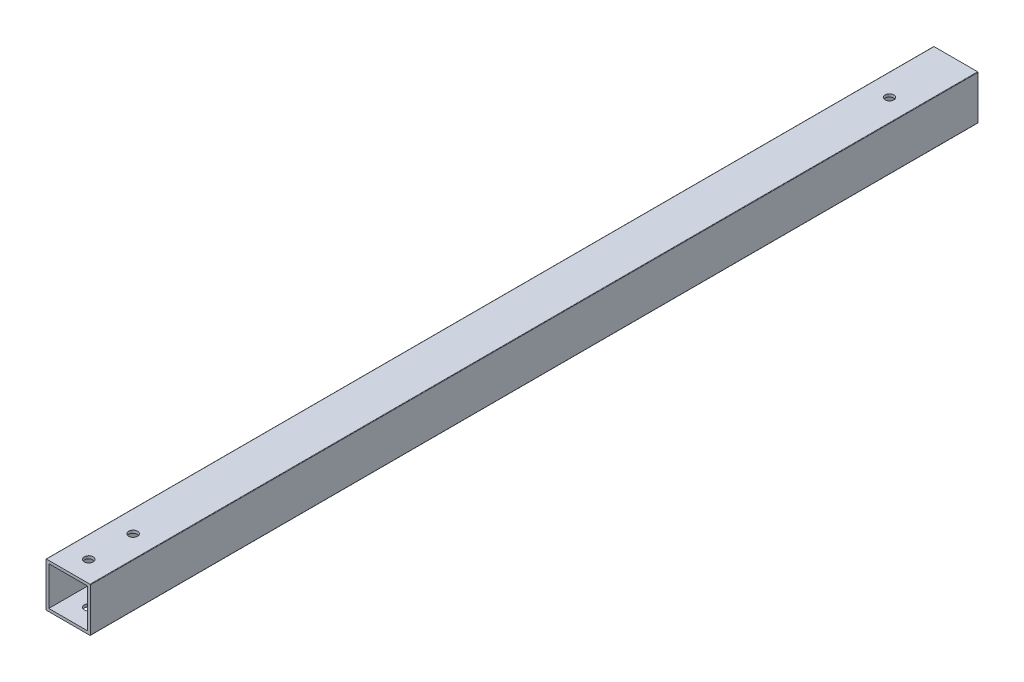
ISO-10303-21;
HEADER;
FILE_DESCRIPTION(('STEP AP214'),'2;1');
FILE_NAME('part.step','',(''),(''),'','','');
FILE_SCHEMA(('AUTOMOTIVE_DESIGN { 1 0 10303 214 1 1 1 1 }'));
ENDSEC;
DATA;
#1=APPLICATION_CONTEXT('core data for automotive mechanical design processes');
#2=APPLICATION_PROTOCOL_DEFINITION('international standard','automotive_design',2000,#1);
#3=PRODUCT_CONTEXT('',#1,'mechanical');
#4=PRODUCT('Part','Part','',(#3));
#5=PRODUCT_RELATED_PRODUCT_CATEGORY('part','',(#4));
#6=PRODUCT_DEFINITION_FORMATION('','',#4);
#7=PRODUCT_DEFINITION_CONTEXT('part definition',#1,'design');
#8=PRODUCT_DEFINITION('design','',#6,#7);
#9=PRODUCT_DEFINITION_SHAPE('','',#8);
#10=(LENGTH_UNIT() NAMED_UNIT(*) SI_UNIT(.MILLI.,.METRE.));
#11=(NAMED_UNIT(*) PLANE_ANGLE_UNIT() SI_UNIT($,.RADIAN.));
#12=(NAMED_UNIT(*) SI_UNIT($,.STERADIAN.) SOLID_ANGLE_UNIT());
#13=UNCERTAINTY_MEASURE_WITH_UNIT(LENGTH_MEASURE(1.E-05),#10,'distance_accuracy_value','');
#14=(GEOMETRIC_REPRESENTATION_CONTEXT(3) GLOBAL_UNCERTAINTY_ASSIGNED_CONTEXT((#13)) GLOBAL_UNIT_ASSIGNED_CONTEXT((#10,
#11,#12)) REPRESENTATION_CONTEXT('',''));
#15=CARTESIAN_POINT('',(0.,0.,0.));
#16=DIRECTION('',(0.,0.,1.));
#17=DIRECTION('',(1.,0.,0.));
#18=AXIS2_PLACEMENT_3D('',#15,#16,#17);
#19=CARTESIAN_POINT('',(-1.33350000000001,-1.3335,508.));
#20=DIRECTION('',(0.,0.,-1.));
#21=DIRECTION('',(-1.,0.,0.));
#22=AXIS2_PLACEMENT_3D('',#19,#20,#21);
#23=CYLINDRICAL_SURFACE('',#22,0.253999999999997);
#24=CARTESIAN_POINT('',(-1.33350000000001,-1.3335,0.));
#25=DIRECTION('',(0.,0.,-1.));
#26=DIRECTION('',(-1.,0.,0.));
#27=AXIS2_PLACEMENT_3D('',#24,#25,#26);
#28=CIRCLE('',#27,0.253999999999997);
#29=CARTESIAN_POINT('',(-1.33350000000001,-1.5875,0.));
#30=VERTEX_POINT('',#29);
#31=CARTESIAN_POINT('',(-1.5875,-1.3335,0.));
#32=VERTEX_POINT('',#31);
#33=EDGE_CURVE('E158',#30,#32,#28,.T.);
#34=ORIENTED_EDGE('',*,*,#33,.F.);
#35=DIRECTION('',(0.,0.,-1.));
#36=VECTOR('',#35,1.);
#37=CARTESIAN_POINT('',(-1.33350000000001,-1.5875,508.));
#38=LINE('',#37,#36);
#39=CARTESIAN_POINT('',(-1.33350000000001,-1.5875,508.));
#40=VERTEX_POINT('',#39);
#41=EDGE_CURVE('E11',#40,#30,#38,.T.);
#42=ORIENTED_EDGE('',*,*,#41,.F.);
#43=CARTESIAN_POINT('',(-1.33350000000001,-1.3335,508.));
#44=DIRECTION('',(0.,0.,-1.));
#45=DIRECTION('',(-1.,0.,0.));
#46=AXIS2_PLACEMENT_3D('',#43,#44,#45);
#47=CIRCLE('',#46,0.253999999999997);
#48=CARTESIAN_POINT('',(-1.5875,-1.3335,508.));
#49=VERTEX_POINT('',#48);
#50=EDGE_CURVE('E162',#40,#49,#47,.T.);
#51=ORIENTED_EDGE('',*,*,#50,.T.);
#52=DIRECTION('',(0.,0.,-1.));
#53=VECTOR('',#52,1.);
#54=CARTESIAN_POINT('',(-1.5875,-1.3335,508.));
#55=LINE('',#54,#53);
#56=EDGE_CURVE('E187',#49,#32,#55,.T.);
#57=ORIENTED_EDGE('',*,*,#56,.T.);
#58=EDGE_LOOP('',(#34,#42,#51,#57));
#59=FACE_BOUND('',#58,.T.);
#60=ADVANCED_FACE('F33',(#59),#23,.T.);
#61=CARTESIAN_POINT('',(23.5585,-1.5875,508.));
#62=DIRECTION('',(0.,-1.,0.));
#63=DIRECTION('',(1.,0.,0.));
#64=AXIS2_PLACEMENT_3D('',#61,#62,#63);
#65=PLANE('',#64);
#66=CARTESIAN_POINT('',(11.1125,-1.5875,37.933268304));
#67=DIRECTION('',(0.,1.,0.));
#68=DIRECTION('',(0.,0.,1.));
#69=AXIS2_PLACEMENT_3D('',#66,#67,#68);
#70=CIRCLE('',#69,2.4892);
#71=CARTESIAN_POINT('',(11.1125,-1.5875,40.422468304));
#72=VERTEX_POINT('',#71);
#73=EDGE_CURVE('E252',#72,#72,#70,.T.);
#74=ORIENTED_EDGE('',*,*,#73,.T.);
#75=EDGE_LOOP('',(#74));
#76=FACE_BOUND('',#75,.T.);
#77=CARTESIAN_POINT('',(10.9125000000001,-1.5875,470.65));
#78=DIRECTION('',(0.,-1.,0.));
#79=DIRECTION('',(1.,0.,0.));
#80=AXIS2_PLACEMENT_3D('',#77,#78,#79);
#81=CIRCLE('',#80,2.54);
#82=CARTESIAN_POINT('',(13.4525000000001,-1.5875,470.65));
#83=VERTEX_POINT('',#82);
#84=EDGE_CURVE('E242',#83,#83,#81,.T.);
#85=ORIENTED_EDGE('',*,*,#84,.F.);
#86=EDGE_LOOP('',(#85));
#87=FACE_BOUND('',#86,.T.);
#88=CARTESIAN_POINT('',(10.9125000000001,-1.5875,496.05));
#89=DIRECTION('',(0.,-1.,0.));
#90=DIRECTION('',(1.,0.,0.));
#91=AXIS2_PLACEMENT_3D('',#88,#89,#90);
#92=CIRCLE('',#91,2.54000000000002);
#93=CARTESIAN_POINT('',(13.4525000000001,-1.5875,496.05));
#94=VERTEX_POINT('',#93);
#95=EDGE_CURVE('E235',#94,#94,#92,.T.);
#96=ORIENTED_EDGE('',*,*,#95,.F.);
#97=EDGE_LOOP('',(#96));
#98=FACE_BOUND('',#97,.T.);
#99=DIRECTION('',(-1.,0.,0.));
#100=VECTOR('',#99,1.);
#101=CARTESIAN_POINT('',(23.5585,-1.5875,0.));
#102=LINE('',#101,#100);
#103=CARTESIAN_POINT('',(23.5585,-1.5875,0.));
#104=VERTEX_POINT('',#103);
#105=EDGE_CURVE('E166',#104,#30,#102,.T.);
#106=ORIENTED_EDGE('',*,*,#105,.F.);
#107=DIRECTION('',(0.,0.,-1.));
#108=VECTOR('',#107,1.);
#109=CARTESIAN_POINT('',(23.5585,-1.5875,508.));
#110=LINE('',#109,#108);
#111=CARTESIAN_POINT('',(23.5585,-1.5875,508.));
#112=VERTEX_POINT('',#111);
#113=EDGE_CURVE('E41',#112,#104,#110,.T.);
#114=ORIENTED_EDGE('',*,*,#113,.F.);
#115=DIRECTION('',(-1.,0.,0.));
#116=VECTOR('',#115,1.);
#117=CARTESIAN_POINT('',(23.5585,-1.5875,508.));
#118=LINE('',#117,#116);
#119=EDGE_CURVE('E184',#112,#40,#118,.T.);
#120=ORIENTED_EDGE('',*,*,#119,.T.);
#121=ORIENTED_EDGE('',*,*,#41,.T.);
#122=EDGE_LOOP('',(#106,#114,#120,#121));
#123=FACE_BOUND('',#122,.T.);
#124=ADVANCED_FACE('F276',(#76,#87,#98,#123),#65,.T.);
#125=CARTESIAN_POINT('',(23.5585,-1.3335,508.));
#126=DIRECTION('',(0.,0.,-1.));
#127=DIRECTION('',(-1.,0.,0.));
#128=AXIS2_PLACEMENT_3D('',#125,#126,#127);
#129=CYLINDRICAL_SURFACE('',#128,0.253999999999998);
#130=CARTESIAN_POINT('',(23.5585,-1.3335,0.));
#131=DIRECTION('',(0.,0.,-1.));
#132=DIRECTION('',(-1.,0.,0.));
#133=AXIS2_PLACEMENT_3D('',#130,#131,#132);
#134=CIRCLE('',#133,0.253999999999998);
#135=CARTESIAN_POINT('',(23.8125,-1.3335,0.));
#136=VERTEX_POINT('',#135);
#137=EDGE_CURVE('E205',#136,#104,#134,.T.);
#138=ORIENTED_EDGE('',*,*,#137,.F.);
#139=DIRECTION('',(0.,0.,-1.));
#140=VECTOR('',#139,1.);
#141=CARTESIAN_POINT('',(23.8125,-1.3335,508.));
#142=LINE('',#141,#140);
#143=CARTESIAN_POINT('',(23.8125,-1.3335,508.));
#144=VERTEX_POINT('',#143);
#145=EDGE_CURVE('E211',#144,#136,#142,.T.);
#146=ORIENTED_EDGE('',*,*,#145,.F.);
#147=CARTESIAN_POINT('',(23.5585,-1.3335,508.));
#148=DIRECTION('',(0.,0.,-1.));
#149=DIRECTION('',(-1.,0.,0.));
#150=AXIS2_PLACEMENT_3D('',#147,#148,#149);
#151=CIRCLE('',#150,0.253999999999998);
#152=EDGE_CURVE('E181',#144,#112,#151,.T.);
#153=ORIENTED_EDGE('',*,*,#152,.T.);
#154=ORIENTED_EDGE('',*,*,#113,.T.);
#155=EDGE_LOOP('',(#138,#146,#153,#154));
#156=FACE_BOUND('',#155,.T.);
#157=ADVANCED_FACE('F281',(#156),#129,.T.);
#158=CARTESIAN_POINT('',(23.8125,23.5585,508.));
#159=DIRECTION('',(1.,0.,0.));
#160=DIRECTION('',(0.,1.,0.));
#161=AXIS2_PLACEMENT_3D('',#158,#159,#160);
#162=PLANE('',#161);
#163=DIRECTION('',(0.,-1.,0.));
#164=VECTOR('',#163,1.);
#165=CARTESIAN_POINT('',(23.8125,23.5585,0.));
#166=LINE('',#165,#164);
#167=CARTESIAN_POINT('',(23.8125,23.5585,0.));
#168=VERTEX_POINT('',#167);
#169=EDGE_CURVE('E202',#168,#136,#166,.T.);
#170=ORIENTED_EDGE('',*,*,#169,.F.);
#171=DIRECTION('',(0.,0.,-1.));
#172=VECTOR('',#171,1.);
#173=CARTESIAN_POINT('',(23.8125,23.5585,508.));
#174=LINE('',#173,#172);
#175=CARTESIAN_POINT('',(23.8125,23.5585,508.));
#176=VERTEX_POINT('',#175);
#177=EDGE_CURVE('E213',#176,#168,#174,.T.);
#178=ORIENTED_EDGE('',*,*,#177,.F.);
#179=DIRECTION('',(0.,-1.,0.));
#180=VECTOR('',#179,1.);
#181=CARTESIAN_POINT('',(23.8125,23.5585,508.));
#182=LINE('',#181,#180);
#183=EDGE_CURVE('E178',#176,#144,#182,.T.);
#184=ORIENTED_EDGE('',*,*,#183,.T.);
#185=ORIENTED_EDGE('',*,*,#145,.T.);
#186=EDGE_LOOP('',(#170,#178,#184,#185));
#187=FACE_BOUND('',#186,.T.);
#188=ADVANCED_FACE('F311',(#187),#162,.T.);
#189=CARTESIAN_POINT('',(23.5585,23.5585,508.));
#190=DIRECTION('',(0.,0.,-1.));
#191=DIRECTION('',(-1.,0.,0.));
#192=AXIS2_PLACEMENT_3D('',#189,#190,#191);
#193=CYLINDRICAL_SURFACE('',#192,0.254000000000001);
#194=CARTESIAN_POINT('',(23.5585,23.5585,0.));
#195=DIRECTION('',(0.,0.,-1.));
#196=DIRECTION('',(-1.,0.,0.));
#197=AXIS2_PLACEMENT_3D('',#194,#195,#196);
#198=CIRCLE('',#197,0.254000000000001);
#199=CARTESIAN_POINT('',(23.5585,23.8125,0.));
#200=VERTEX_POINT('',#199);
#201=EDGE_CURVE('E199',#200,#168,#198,.T.);
#202=ORIENTED_EDGE('',*,*,#201,.F.);
#203=DIRECTION('',(0.,0.,-1.));
#204=VECTOR('',#203,1.);
#205=CARTESIAN_POINT('',(23.5585,23.8125,508.));
#206=LINE('',#205,#204);
#207=CARTESIAN_POINT('',(23.5585,23.8125,508.));
#208=VERTEX_POINT('',#207);
#209=EDGE_CURVE('E215',#208,#200,#206,.T.);
#210=ORIENTED_EDGE('',*,*,#209,.F.);
#211=CARTESIAN_POINT('',(23.5585,23.5585,508.));
#212=DIRECTION('',(0.,0.,-1.));
#213=DIRECTION('',(-1.,0.,0.));
#214=AXIS2_PLACEMENT_3D('',#211,#212,#213);
#215=CIRCLE('',#214,0.254000000000001);
#216=EDGE_CURVE('E175',#208,#176,#215,.T.);
#217=ORIENTED_EDGE('',*,*,#216,.T.);
#218=ORIENTED_EDGE('',*,*,#177,.T.);
#219=EDGE_LOOP('',(#202,#210,#217,#218));
#220=FACE_BOUND('',#219,.T.);
#221=ADVANCED_FACE('F308',(#220),#193,.T.);
#222=CARTESIAN_POINT('',(-1.33350000000001,23.8125,508.));
#223=DIRECTION('',(0.,1.,0.));
#224=DIRECTION('',(0.,0.,1.));
#225=AXIS2_PLACEMENT_3D('',#222,#223,#224);
#226=PLANE('',#225);
#227=CARTESIAN_POINT('',(11.1125,23.8125,37.933268304));
#228=DIRECTION('',(0.,1.,0.));
#229=DIRECTION('',(0.,0.,1.));
#230=AXIS2_PLACEMENT_3D('',#227,#228,#229);
#231=CIRCLE('',#230,2.4892);
#232=CARTESIAN_POINT('',(11.1125,23.8125,40.422468304));
#233=VERTEX_POINT('',#232);
#234=EDGE_CURVE('E249',#233,#233,#231,.T.);
#235=ORIENTED_EDGE('',*,*,#234,.F.);
#236=EDGE_LOOP('',(#235));
#237=FACE_BOUND('',#236,.T.);
#238=CARTESIAN_POINT('',(10.9125000000001,23.8125,470.65));
#239=DIRECTION('',(0.,-1.,0.));
#240=DIRECTION('',(1.,0.,0.));
#241=AXIS2_PLACEMENT_3D('',#238,#239,#240);
#242=CIRCLE('',#241,2.54);
#243=CARTESIAN_POINT('',(13.4525000000001,23.8125,470.65));
#244=VERTEX_POINT('',#243);
#245=EDGE_CURVE('E225',#244,#244,#242,.T.);
#246=ORIENTED_EDGE('',*,*,#245,.T.);
#247=EDGE_LOOP('',(#246));
#248=FACE_BOUND('',#247,.T.);
#249=CARTESIAN_POINT('',(10.9125000000001,23.8125,496.05));
#250=DIRECTION('',(0.,-1.,0.));
#251=DIRECTION('',(1.,0.,0.));
#252=AXIS2_PLACEMENT_3D('',#249,#250,#251);
#253=CIRCLE('',#252,2.54000000000002);
#254=CARTESIAN_POINT('',(13.4525000000001,23.8125,496.05));
#255=VERTEX_POINT('',#254);
#256=EDGE_CURVE('E238',#255,#255,#253,.T.);
#257=ORIENTED_EDGE('',*,*,#256,.T.);
#258=EDGE_LOOP('',(#257));
#259=FACE_BOUND('',#258,.T.);
#260=DIRECTION('',(1.,0.,0.));
#261=VECTOR('',#260,1.);
#262=CARTESIAN_POINT('',(-1.33350000000001,23.8125,0.));
#263=LINE('',#262,#261);
#264=CARTESIAN_POINT('',(-1.33350000000001,23.8125,0.));
#265=VERTEX_POINT('',#264);
#266=EDGE_CURVE('E196',#265,#200,#263,.T.);
#267=ORIENTED_EDGE('',*,*,#266,.F.);
#268=DIRECTION('',(0.,0.,-1.));
#269=VECTOR('',#268,1.);
#270=CARTESIAN_POINT('',(-1.33350000000001,23.8125,508.));
#271=LINE('',#270,#269);
#272=CARTESIAN_POINT('',(-1.33350000000001,23.8125,508.));
#273=VERTEX_POINT('',#272);
#274=EDGE_CURVE('E217',#273,#265,#271,.T.);
#275=ORIENTED_EDGE('',*,*,#274,.F.);
#276=DIRECTION('',(1.,0.,0.));
#277=VECTOR('',#276,1.);
#278=CARTESIAN_POINT('',(-1.33350000000001,23.8125,508.));
#279=LINE('',#278,#277);
#280=EDGE_CURVE('E172',#273,#208,#279,.T.);
#281=ORIENTED_EDGE('',*,*,#280,.T.);
#282=ORIENTED_EDGE('',*,*,#209,.T.);
#283=EDGE_LOOP('',(#267,#275,#281,#282));
#284=FACE_BOUND('',#283,.T.);
#285=ADVANCED_FACE('F304',(#237,#248,#259,#284),#226,.T.);
#286=CARTESIAN_POINT('',(-1.33350000000001,23.5585,508.));
#287=DIRECTION('',(0.,0.,-1.));
#288=DIRECTION('',(-1.,0.,0.));
#289=AXIS2_PLACEMENT_3D('',#286,#287,#288);
#290=CYLINDRICAL_SURFACE('',#289,0.253999999999992);
#291=CARTESIAN_POINT('',(-1.33350000000001,23.5585,0.));
#292=DIRECTION('',(0.,0.,-1.));
#293=DIRECTION('',(-1.,0.,0.));
#294=AXIS2_PLACEMENT_3D('',#291,#292,#293);
#295=CIRCLE('',#294,0.253999999999992);
#296=CARTESIAN_POINT('',(-1.5875,23.5585,0.));
#297=VERTEX_POINT('',#296);
#298=EDGE_CURVE('E193',#297,#265,#295,.T.);
#299=ORIENTED_EDGE('',*,*,#298,.F.);
#300=DIRECTION('',(0.,0.,-1.));
#301=VECTOR('',#300,1.);
#302=CARTESIAN_POINT('',(-1.5875,23.5585,508.));
#303=LINE('',#302,#301);
#304=CARTESIAN_POINT('',(-1.5875,23.5585,508.));
#305=VERTEX_POINT('',#304);
#306=EDGE_CURVE('E219',#305,#297,#303,.T.);
#307=ORIENTED_EDGE('',*,*,#306,.F.);
#308=CARTESIAN_POINT('',(-1.33350000000001,23.5585,508.));
#309=DIRECTION('',(0.,0.,-1.));
#310=DIRECTION('',(-1.,0.,0.));
#311=AXIS2_PLACEMENT_3D('',#308,#309,#310);
#312=CIRCLE('',#311,0.253999999999992);
#313=EDGE_CURVE('E169',#305,#273,#312,.T.);
#314=ORIENTED_EDGE('',*,*,#313,.T.);
#315=ORIENTED_EDGE('',*,*,#274,.T.);
#316=EDGE_LOOP('',(#299,#307,#314,#315));
#317=FACE_BOUND('',#316,.T.);
#318=ADVANCED_FACE('F302',(#317),#290,.T.);
#319=CARTESIAN_POINT('',(-1.5875,-1.3335,508.));
#320=DIRECTION('',(-1.,0.,0.));
#321=DIRECTION('',(0.,-1.,0.));
#322=AXIS2_PLACEMENT_3D('',#319,#320,#321);
#323=PLANE('',#322);
#324=DIRECTION('',(0.,1.,0.));
#325=VECTOR('',#324,1.);
#326=CARTESIAN_POINT('',(-1.5875,-1.3335,0.));
#327=LINE('',#326,#325);
#328=EDGE_CURVE('E190',#32,#297,#327,.T.);
#329=ORIENTED_EDGE('',*,*,#328,.F.);
#330=ORIENTED_EDGE('',*,*,#56,.F.);
#331=DIRECTION('',(0.,1.,0.));
#332=VECTOR('',#331,1.);
#333=CARTESIAN_POINT('',(-1.5875,-1.3335,508.));
#334=LINE('',#333,#332);
#335=EDGE_CURVE('E165',#49,#305,#334,.T.);
#336=ORIENTED_EDGE('',*,*,#335,.T.);
#337=ORIENTED_EDGE('',*,*,#306,.T.);
#338=EDGE_LOOP('',(#329,#330,#336,#337));
#339=FACE_BOUND('',#338,.T.);
#340=ADVANCED_FACE('F298',(#339),#323,.T.);
#341=CARTESIAN_POINT('',(-1.33350000000001,-1.3335,508.));
#342=DIRECTION('',(0.,0.,-1.));
#343=DIRECTION('',(-1.,0.,0.));
#344=AXIS2_PLACEMENT_3D('',#341,#342,#343);
#345=PLANE('',#344);
#346=DIRECTION('',(1.,0.,0.));
#347=VECTOR('',#346,1.);
#348=CARTESIAN_POINT('',(0.,22.225,508.));
#349=LINE('',#348,#347);
#350=CARTESIAN_POINT('',(0.,22.225,508.));
#351=VERTEX_POINT('',#350);
#352=CARTESIAN_POINT('',(22.225,22.225,508.));
#353=VERTEX_POINT('',#352);
#354=EDGE_CURVE('E130',#351,#353,#349,.T.);
#355=ORIENTED_EDGE('',*,*,#354,.T.);
#356=DIRECTION('',(0.,-1.,0.));
#357=VECTOR('',#356,1.);
#358=CARTESIAN_POINT('',(22.225,22.225,508.));
#359=LINE('',#358,#357);
#360=CARTESIAN_POINT('',(22.225,0.,508.));
#361=VERTEX_POINT('',#360);
#362=EDGE_CURVE('E124',#353,#361,#359,.T.);
#363=ORIENTED_EDGE('',*,*,#362,.T.);
#364=DIRECTION('',(-1.,0.,0.));
#365=VECTOR('',#364,1.);
#366=CARTESIAN_POINT('',(0.,0.,508.));
#367=LINE('',#366,#365);
#368=CARTESIAN_POINT('',(0.,0.,508.));
#369=VERTEX_POINT('',#368);
#370=EDGE_CURVE('E133',#361,#369,#367,.T.);
#371=ORIENTED_EDGE('',*,*,#370,.T.);
#372=DIRECTION('',(0.,1.,0.));
#373=VECTOR('',#372,1.);
#374=CARTESIAN_POINT('',(0.,22.225,508.));
#375=LINE('',#374,#373);
#376=EDGE_CURVE('E49',#369,#351,#375,.T.);
#377=ORIENTED_EDGE('',*,*,#376,.T.);
#378=EDGE_LOOP('',(#355,#363,#371,#377));
#379=FACE_BOUND('',#378,.T.);
#380=ORIENTED_EDGE('',*,*,#50,.F.);
#381=ORIENTED_EDGE('',*,*,#119,.F.);
#382=ORIENTED_EDGE('',*,*,#152,.F.);
#383=ORIENTED_EDGE('',*,*,#183,.F.);
#384=ORIENTED_EDGE('',*,*,#216,.F.);
#385=ORIENTED_EDGE('',*,*,#280,.F.);
#386=ORIENTED_EDGE('',*,*,#313,.F.);
#387=ORIENTED_EDGE('',*,*,#335,.F.);
#388=EDGE_LOOP('',(#380,#381,#382,#383,#384,#385,#386,#387));
#389=FACE_BOUND('',#388,.T.);
#390=ADVANCED_FACE('F137',(#379,#389),#345,.F.);
#391=CARTESIAN_POINT('',(-1.33350000000001,-1.3335,0.));
#392=DIRECTION('',(0.,0.,-1.));
#393=DIRECTION('',(-1.,0.,0.));
#394=AXIS2_PLACEMENT_3D('',#391,#392,#393);
#395=PLANE('',#394);
#396=DIRECTION('',(0.,-1.,0.));
#397=VECTOR('',#396,1.);
#398=CARTESIAN_POINT('',(22.225,22.225,0.));
#399=LINE('',#398,#397);
#400=CARTESIAN_POINT('',(22.225,22.225,0.));
#401=VERTEX_POINT('',#400);
#402=CARTESIAN_POINT('',(22.225,0.,0.));
#403=VERTEX_POINT('',#402);
#404=EDGE_CURVE('E57',#401,#403,#399,.T.);
#405=ORIENTED_EDGE('',*,*,#404,.F.);
#406=DIRECTION('',(1.,0.,0.));
#407=VECTOR('',#406,1.);
#408=CARTESIAN_POINT('',(0.,22.225,0.));
#409=LINE('',#408,#407);
#410=CARTESIAN_POINT('',(0.,22.225,0.));
#411=VERTEX_POINT('',#410);
#412=EDGE_CURVE('E140',#411,#401,#409,.T.);
#413=ORIENTED_EDGE('',*,*,#412,.F.);
#414=DIRECTION('',(0.,1.,0.));
#415=VECTOR('',#414,1.);
#416=CARTESIAN_POINT('',(0.,22.225,0.));
#417=LINE('',#416,#415);
#418=CARTESIAN_POINT('',(0.,0.,0.));
#419=VERTEX_POINT('',#418);
#420=EDGE_CURVE('E143',#419,#411,#417,.T.);
#421=ORIENTED_EDGE('',*,*,#420,.F.);
#422=DIRECTION('',(-1.,0.,0.));
#423=VECTOR('',#422,1.);
#424=CARTESIAN_POINT('',(0.,0.,0.));
#425=LINE('',#424,#423);
#426=EDGE_CURVE('E152',#403,#419,#425,.T.);
#427=ORIENTED_EDGE('',*,*,#426,.F.);
#428=EDGE_LOOP('',(#405,#413,#421,#427));
#429=FACE_BOUND('',#428,.T.);
#430=ORIENTED_EDGE('',*,*,#33,.T.);
#431=ORIENTED_EDGE('',*,*,#328,.T.);
#432=ORIENTED_EDGE('',*,*,#298,.T.);
#433=ORIENTED_EDGE('',*,*,#266,.T.);
#434=ORIENTED_EDGE('',*,*,#201,.T.);
#435=ORIENTED_EDGE('',*,*,#169,.T.);
#436=ORIENTED_EDGE('',*,*,#137,.T.);
#437=ORIENTED_EDGE('',*,*,#105,.T.);
#438=EDGE_LOOP('',(#430,#431,#432,#433,#434,#435,#436,#437));
#439=FACE_BOUND('',#438,.T.);
#440=ADVANCED_FACE('F288',(#429,#439),#395,.T.);
#441=CARTESIAN_POINT('',(22.225,22.225,508.));
#442=DIRECTION('',(1.,0.,0.));
#443=DIRECTION('',(0.,1.,0.));
#444=AXIS2_PLACEMENT_3D('',#441,#442,#443);
#445=PLANE('',#444);
#446=ORIENTED_EDGE('',*,*,#404,.T.);
#447=DIRECTION('',(0.,0.,-1.));
#448=VECTOR('',#447,1.);
#449=CARTESIAN_POINT('',(22.225,0.,508.));
#450=LINE('',#449,#448);
#451=EDGE_CURVE('E120',#361,#403,#450,.T.);
#452=ORIENTED_EDGE('',*,*,#451,.F.);
#453=ORIENTED_EDGE('',*,*,#362,.F.);
#454=DIRECTION('',(0.,0.,-1.));
#455=VECTOR('',#454,1.);
#456=CARTESIAN_POINT('',(22.225,22.225,508.));
#457=LINE('',#456,#455);
#458=EDGE_CURVE('E156',#353,#401,#457,.T.);
#459=ORIENTED_EDGE('',*,*,#458,.T.);
#460=EDGE_LOOP('',(#446,#452,#453,#459));
#461=FACE_BOUND('',#460,.T.);
#462=ADVANCED_FACE('F122',(#461),#445,.F.);
#463=CARTESIAN_POINT('',(0.,22.225,508.));
#464=DIRECTION('',(0.,1.,0.));
#465=DIRECTION('',(-1.,0.,0.));
#466=AXIS2_PLACEMENT_3D('',#463,#464,#465);
#467=PLANE('',#466);
#468=CARTESIAN_POINT('',(11.1125,22.225,37.933268304));
#469=DIRECTION('',(0.,1.,0.));
#470=DIRECTION('',(-1.,0.,0.));
#471=AXIS2_PLACEMENT_3D('',#468,#469,#470);
#472=CIRCLE('',#471,2.4892);
#473=CARTESIAN_POINT('',(8.6233,22.225,37.933268304));
#474=VERTEX_POINT('',#473);
#475=EDGE_CURVE('E239',#474,#474,#472,.T.);
#476=ORIENTED_EDGE('',*,*,#475,.T.);
#477=EDGE_LOOP('',(#476));
#478=FACE_BOUND('',#477,.T.);
#479=CARTESIAN_POINT('',(10.9125000000001,22.225,470.65));
#480=DIRECTION('',(0.,1.,0.));
#481=DIRECTION('',(-1.,0.,0.));
#482=AXIS2_PLACEMENT_3D('',#479,#480,#481);
#483=CIRCLE('',#482,2.54);
#484=CARTESIAN_POINT('',(8.37250000000008,22.225,470.65));
#485=VERTEX_POINT('',#484);
#486=EDGE_CURVE('E146',#485,#485,#483,.T.);
#487=ORIENTED_EDGE('',*,*,#486,.T.);
#488=EDGE_LOOP('',(#487));
#489=FACE_BOUND('',#488,.T.);
#490=CARTESIAN_POINT('',(10.9125000000001,22.225,496.05));
#491=DIRECTION('',(0.,1.,0.));
#492=DIRECTION('',(-1.,0.,0.));
#493=AXIS2_PLACEMENT_3D('',#490,#491,#492);
#494=CIRCLE('',#493,2.54000000000002);
#495=CARTESIAN_POINT('',(8.37250000000006,22.225,496.05));
#496=VERTEX_POINT('',#495);
#497=EDGE_CURVE('E224',#496,#496,#494,.T.);
#498=ORIENTED_EDGE('',*,*,#497,.T.);
#499=EDGE_LOOP('',(#498));
#500=FACE_BOUND('',#499,.T.);
#501=ORIENTED_EDGE('',*,*,#412,.T.);
#502=ORIENTED_EDGE('',*,*,#458,.F.);
#503=ORIENTED_EDGE('',*,*,#354,.F.);
#504=DIRECTION('',(0.,0.,-1.));
#505=VECTOR('',#504,1.);
#506=CARTESIAN_POINT('',(0.,22.225,508.));
#507=LINE('',#506,#505);
#508=EDGE_CURVE('E159',#351,#411,#507,.T.);
#509=ORIENTED_EDGE('',*,*,#508,.T.);
#510=EDGE_LOOP('',(#501,#502,#503,#509));
#511=FACE_BOUND('',#510,.T.);
#512=ADVANCED_FACE('F339',(#478,#489,#500,#511),#467,.F.);
#513=CARTESIAN_POINT('',(0.,22.225,508.));
#514=DIRECTION('',(-1.,0.,0.));
#515=DIRECTION('',(0.,-1.,0.));
#516=AXIS2_PLACEMENT_3D('',#513,#514,#515);
#517=PLANE('',#516);
#518=ORIENTED_EDGE('',*,*,#420,.T.);
#519=ORIENTED_EDGE('',*,*,#508,.F.);
#520=ORIENTED_EDGE('',*,*,#376,.F.);
#521=DIRECTION('',(0.,0.,-1.));
#522=VECTOR('',#521,1.);
#523=CARTESIAN_POINT('',(0.,0.,508.));
#524=LINE('',#523,#522);
#525=EDGE_CURVE('E129',#369,#419,#524,.T.);
#526=ORIENTED_EDGE('',*,*,#525,.T.);
#527=EDGE_LOOP('',(#518,#519,#520,#526));
#528=FACE_BOUND('',#527,.T.);
#529=ADVANCED_FACE('F343',(#528),#517,.F.);
#530=CARTESIAN_POINT('',(0.,0.,508.));
#531=DIRECTION('',(0.,-1.,0.));
#532=DIRECTION('',(1.,0.,0.));
#533=AXIS2_PLACEMENT_3D('',#530,#531,#532);
#534=PLANE('',#533);
#535=CARTESIAN_POINT('',(11.1125,0.,37.933268304));
#536=DIRECTION('',(0.,-1.,0.));
#537=DIRECTION('',(1.,0.,0.));
#538=AXIS2_PLACEMENT_3D('',#535,#536,#537);
#539=CIRCLE('',#538,2.4892);
#540=CARTESIAN_POINT('',(13.6017,0.,37.933268304));
#541=VERTEX_POINT('',#540);
#542=EDGE_CURVE('E36',#541,#541,#539,.T.);
#543=ORIENTED_EDGE('',*,*,#542,.T.);
#544=EDGE_LOOP('',(#543));
#545=FACE_BOUND('',#544,.T.);
#546=CARTESIAN_POINT('',(10.9125000000001,0.,470.65));
#547=DIRECTION('',(0.,-1.,0.));
#548=DIRECTION('',(1.,0.,0.));
#549=AXIS2_PLACEMENT_3D('',#546,#547,#548);
#550=CIRCLE('',#549,2.54);
#551=CARTESIAN_POINT('',(13.4525000000001,0.,470.65));
#552=VERTEX_POINT('',#551);
#553=EDGE_CURVE('E226',#552,#552,#550,.T.);
#554=ORIENTED_EDGE('',*,*,#553,.T.);
#555=EDGE_LOOP('',(#554));
#556=FACE_BOUND('',#555,.T.);
#557=CARTESIAN_POINT('',(10.9125000000001,0.,496.05));
#558=DIRECTION('',(0.,-1.,0.));
#559=DIRECTION('',(1.,0.,0.));
#560=AXIS2_PLACEMENT_3D('',#557,#558,#559);
#561=CIRCLE('',#560,2.54000000000002);
#562=CARTESIAN_POINT('',(13.4525000000001,0.,496.05));
#563=VERTEX_POINT('',#562);
#564=EDGE_CURVE('E222',#563,#563,#561,.T.);
#565=ORIENTED_EDGE('',*,*,#564,.T.);
#566=EDGE_LOOP('',(#565));
#567=FACE_BOUND('',#566,.T.);
#568=ORIENTED_EDGE('',*,*,#426,.T.);
#569=ORIENTED_EDGE('',*,*,#525,.F.);
#570=ORIENTED_EDGE('',*,*,#370,.F.);
#571=ORIENTED_EDGE('',*,*,#451,.T.);
#572=EDGE_LOOP('',(#568,#569,#570,#571));
#573=FACE_BOUND('',#572,.T.);
#574=ADVANCED_FACE('F134',(#545,#556,#567,#573),#534,.F.);
#575=CARTESIAN_POINT('',(10.9125000000001,23.8125,496.05));
#576=DIRECTION('',(0.,-1.,0.));
#577=DIRECTION('',(1.,0.,0.));
#578=AXIS2_PLACEMENT_3D('',#575,#576,#577);
#579=CYLINDRICAL_SURFACE('',#578,2.54000000000002);
#580=ORIENTED_EDGE('',*,*,#95,.T.);
#581=EDGE_LOOP('',(#580));
#582=FACE_BOUND('',#581,.T.);
#583=ORIENTED_EDGE('',*,*,#564,.F.);
#584=EDGE_LOOP('',(#583));
#585=FACE_BOUND('',#584,.T.);
#586=ADVANCED_FACE('F342',(#582,#585),#579,.F.);
#587=CARTESIAN_POINT('',(10.9125000000001,23.8125,470.65));
#588=DIRECTION('',(0.,-1.,0.));
#589=DIRECTION('',(1.,0.,0.));
#590=AXIS2_PLACEMENT_3D('',#587,#588,#589);
#591=CYLINDRICAL_SURFACE('',#590,2.54);
#592=ORIENTED_EDGE('',*,*,#84,.T.);
#593=EDGE_LOOP('',(#592));
#594=FACE_BOUND('',#593,.T.);
#595=ORIENTED_EDGE('',*,*,#553,.F.);
#596=EDGE_LOOP('',(#595));
#597=FACE_BOUND('',#596,.T.);
#598=ADVANCED_FACE('F274',(#594,#597),#591,.F.);
#599=ORIENTED_EDGE('',*,*,#256,.F.);
#600=EDGE_LOOP('',(#599));
#601=FACE_BOUND('',#600,.T.);
#602=ORIENTED_EDGE('',*,*,#497,.F.);
#603=EDGE_LOOP('',(#602));
#604=FACE_BOUND('',#603,.T.);
#605=ADVANCED_FACE('F271',(#601,#604),#579,.F.);
#606=ORIENTED_EDGE('',*,*,#245,.F.);
#607=EDGE_LOOP('',(#606));
#608=FACE_BOUND('',#607,.T.);
#609=ORIENTED_EDGE('',*,*,#486,.F.);
#610=EDGE_LOOP('',(#609));
#611=FACE_BOUND('',#610,.T.);
#612=ADVANCED_FACE('F263',(#608,#611),#591,.F.);
#613=CARTESIAN_POINT('',(11.1125,-1.5875,37.933268304));
#614=DIRECTION('',(0.,1.,0.));
#615=DIRECTION('',(0.,0.,1.));
#616=AXIS2_PLACEMENT_3D('',#613,#614,#615);
#617=CYLINDRICAL_SURFACE('',#616,2.4892);
#618=ORIENTED_EDGE('',*,*,#73,.F.);
#619=EDGE_LOOP('',(#618));
#620=FACE_BOUND('',#619,.T.);
#621=ORIENTED_EDGE('',*,*,#542,.F.);
#622=EDGE_LOOP('',(#621));
#623=FACE_BOUND('',#622,.T.);
#624=ADVANCED_FACE('F260',(#620,#623),#617,.F.);
#625=ORIENTED_EDGE('',*,*,#234,.T.);
#626=EDGE_LOOP('',(#625));
#627=FACE_BOUND('',#626,.T.);
#628=ORIENTED_EDGE('',*,*,#475,.F.);
#629=EDGE_LOOP('',(#628));
#630=FACE_BOUND('',#629,.T.);
#631=ADVANCED_FACE('F262',(#627,#630),#617,.F.);
#632=CLOSED_SHELL('',(#60,#124,#157,#188,#221,#285,#318,#340,#390,#440,#462,#512,#529,#574,#586,
#598,#605,#612,#624,#631));
#633=MANIFOLD_SOLID_BREP('B2',#632);
#634=ADVANCED_BREP_SHAPE_REPRESENTATION('',(#18,#633),#14);
#635=SHAPE_DEFINITION_REPRESENTATION(#9,#634);
ENDSEC;
END-ISO-10303-21;
